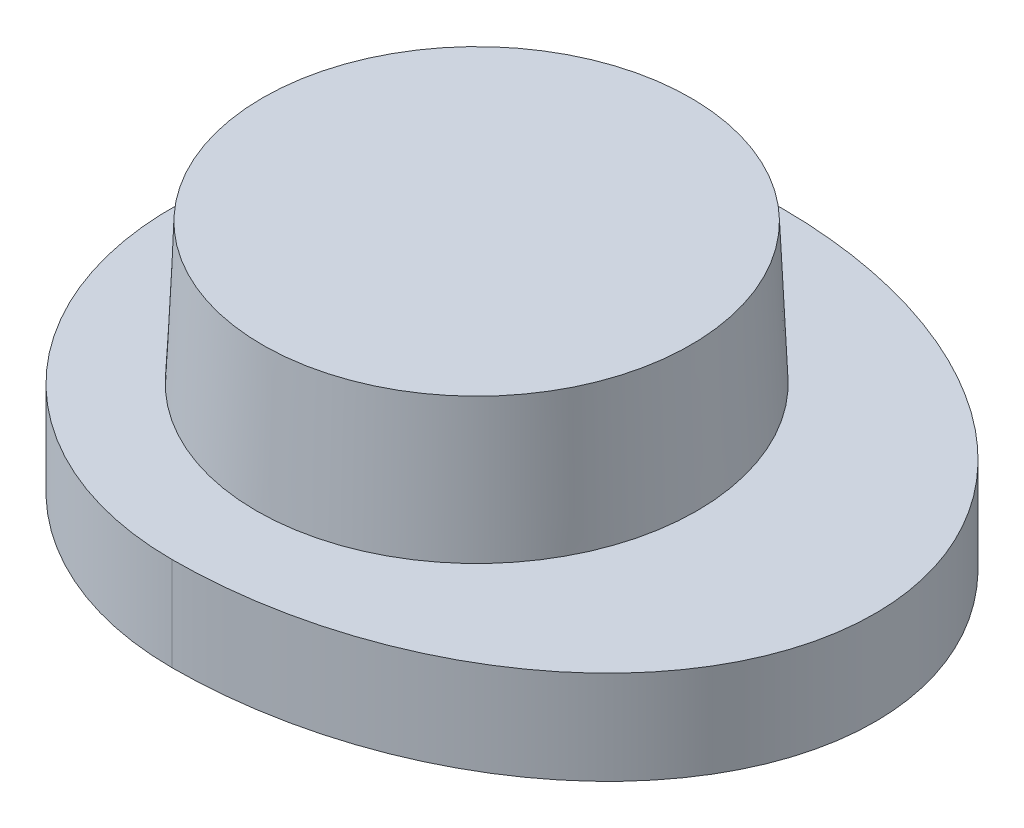
ISO-10303-21;
HEADER;
FILE_DESCRIPTION(('STEP AP214'),'2;1');
FILE_NAME('part.step','',(''),(''),'','','');
FILE_SCHEMA(('AUTOMOTIVE_DESIGN { 1 0 10303 214 1 1 1 1 }'));
ENDSEC;
DATA;
#1=APPLICATION_CONTEXT('core data for automotive mechanical design processes');
#2=APPLICATION_PROTOCOL_DEFINITION('international standard','automotive_design',2000,#1);
#3=PRODUCT_CONTEXT('',#1,'mechanical');
#4=PRODUCT('Part','Part','',(#3));
#5=PRODUCT_RELATED_PRODUCT_CATEGORY('part','',(#4));
#6=PRODUCT_DEFINITION_FORMATION('','',#4);
#7=PRODUCT_DEFINITION_CONTEXT('part definition',#1,'design');
#8=PRODUCT_DEFINITION('design','',#6,#7);
#9=PRODUCT_DEFINITION_SHAPE('','',#8);
#10=(LENGTH_UNIT() NAMED_UNIT(*) SI_UNIT(.MILLI.,.METRE.));
#11=(NAMED_UNIT(*) PLANE_ANGLE_UNIT() SI_UNIT($,.RADIAN.));
#12=(NAMED_UNIT(*) SI_UNIT($,.STERADIAN.) SOLID_ANGLE_UNIT());
#13=UNCERTAINTY_MEASURE_WITH_UNIT(LENGTH_MEASURE(1.E-05),#10,'distance_accuracy_value','');
#14=(GEOMETRIC_REPRESENTATION_CONTEXT(3) GLOBAL_UNCERTAINTY_ASSIGNED_CONTEXT((#13)) GLOBAL_UNIT_ASSIGNED_CONTEXT((#10,
#11,#12)) REPRESENTATION_CONTEXT('',''));
#15=CARTESIAN_POINT('',(0.,0.,0.));
#16=DIRECTION('',(0.,0.,1.));
#17=DIRECTION('',(1.,0.,0.));
#18=AXIS2_PLACEMENT_3D('',#15,#16,#17);
#19=CARTESIAN_POINT('',(3.32292633199457,1.70645834879945,-5.34168726011664E-07));
#20=DIRECTION('',(0.,1.,0.));
#21=DIRECTION('',(-1.,0.,0.));
#22=AXIS2_PLACEMENT_3D('',#19,#20,#21);
#23=PLANE('',#22);
#24=CARTESIAN_POINT('',(22.1229263319946,1.70645834879946,-5.34168726011664E-07));
#25=DIRECTION('',(0.,1.,0.));
#26=DIRECTION('',(-1.,0.,0.));
#27=AXIS2_PLACEMENT_3D('',#24,#25,#26);
#28=CIRCLE('',#27,3.41818181818182);
#29=CARTESIAN_POINT('',(18.7047445138127,1.70645834879945,-5.34168726011664E-07));
#30=VERTEX_POINT('',#29);
#31=EDGE_CURVE('E11',#30,#30,#28,.T.);
#32=ORIENTED_EDGE('',*,*,#31,.F.);
#33=EDGE_LOOP('',(#32));
#34=FACE_BOUND('',#33,.T.);
#35=ADVANCED_FACE('F43',(#34),#23,.F.);
#36=CARTESIAN_POINT('',(22.1229263319946,15.3412072266021,-5.34168726011664E-07));
#37=DIRECTION('',(0.,1.,0.));
#38=DIRECTION('',(-1.,0.,0.));
#39=AXIS2_PLACEMENT_3D('',#36,#37,#38);
#40=CYLINDRICAL_SURFACE('',#39,3.41818181818182);
#41=CARTESIAN_POINT('',(22.1229263319946,-1.71172346938236,-5.34168726011664E-07));
#42=DIRECTION('',(0.,1.,0.));
#43=DIRECTION('',(-1.,0.,0.));
#44=AXIS2_PLACEMENT_3D('',#41,#42,#43);
#45=CIRCLE('',#44,3.41818181818182);
#46=CARTESIAN_POINT('',(18.7047445138127,-1.71172346938236,-5.34168726011664E-07));
#47=VERTEX_POINT('',#46);
#48=EDGE_CURVE('E51',#47,#47,#45,.T.);
#49=ORIENTED_EDGE('',*,*,#48,.F.);
#50=EDGE_LOOP('',(#49));
#51=FACE_BOUND('',#50,.T.);
#52=ORIENTED_EDGE('',*,*,#31,.T.);
#53=EDGE_LOOP('',(#52));
#54=FACE_BOUND('',#53,.T.);
#55=ADVANCED_FACE('F102',(#51,#54),#40,.F.);
#56=CARTESIAN_POINT('',(3.32292633199457,-1.71172346938236,-5.34168726011664E-07));
#57=DIRECTION('',(0.,1.,0.));
#58=DIRECTION('',(-1.,0.,0.));
#59=AXIS2_PLACEMENT_3D('',#56,#57,#58);
#60=PLANE('',#59);
#61=CARTESIAN_POINT('',(22.1229263319946,-1.71172346938236,-5.34168726011664E-07));
#62=DIRECTION('',(0.,-1.,0.));
#63=DIRECTION('',(-1.,0.,0.));
#64=AXIS2_PLACEMENT_3D('',#61,#62,#63);
#65=ELLIPSE('',#64,7.26363636363636,5.55454545454545);
#66=CARTESIAN_POINT('',(22.1229263319946,-1.71172346938236,-5.55454598871418));
#67=VERTEX_POINT('',#66);
#68=CARTESIAN_POINT('',(22.1229263319946,-1.71172346938236,5.55454492037673));
#69=VERTEX_POINT('',#68);
#70=EDGE_CURVE('E58',#67,#69,#65,.T.);
#71=ORIENTED_EDGE('',*,*,#70,.T.);
#72=CARTESIAN_POINT('',(22.1229263319946,-1.71172346938236,-5.34168726011664E-07));
#73=DIRECTION('',(0.,1.,0.));
#74=DIRECTION('',(-1.,0.,0.));
#75=AXIS2_PLACEMENT_3D('',#72,#73,#74);
#76=CIRCLE('',#75,5.55454545454545);
#77=EDGE_CURVE('E87',#67,#69,#76,.T.);
#78=ORIENTED_EDGE('',*,*,#77,.F.);
#79=EDGE_LOOP('',(#71,#78));
#80=FACE_BOUND('',#79,.T.);
#81=ORIENTED_EDGE('',*,*,#48,.T.);
#82=EDGE_LOOP('',(#81));
#83=FACE_BOUND('',#82,.T.);
#84=ADVANCED_FACE('F100',(#80,#83),#60,.F.);
#85=CARTESIAN_POINT('',(22.1229263319946,15.3412072266021,-5.34168726011664E-07));
#86=DIRECTION('',(0.,1.,0.));
#87=DIRECTION('',(-1.,0.,0.));
#88=AXIS2_PLACEMENT_3D('',#85,#86,#87);
#89=CYLINDRICAL_SURFACE('',#88,5.55454545454545);
#90=DIRECTION('',(0.,-1.,0.));
#91=VECTOR('',#90,1.);
#92=CARTESIAN_POINT('',(22.1229263319946,13.2703880184474,5.55454492037673));
#93=LINE('',#92,#91);
#94=CARTESIAN_POINT('',(22.1229263319946,-0.00260388426948021,5.55454492037673));
#95=VERTEX_POINT('',#94);
#96=EDGE_CURVE('E64',#95,#69,#93,.T.);
#97=ORIENTED_EDGE('',*,*,#96,.F.);
#98=CARTESIAN_POINT('',(22.1229263319946,-0.00260388426948317,-5.34168726011664E-07));
#99=DIRECTION('',(0.,1.,0.));
#100=DIRECTION('',(-1.,0.,0.));
#101=AXIS2_PLACEMENT_3D('',#98,#99,#100);
#102=CIRCLE('',#101,5.55454545454545);
#103=CARTESIAN_POINT('',(22.1229263319946,-0.00260388426948317,-5.55454598871418));
#104=VERTEX_POINT('',#103);
#105=EDGE_CURVE('E74',#104,#95,#102,.T.);
#106=ORIENTED_EDGE('',*,*,#105,.F.);
#107=DIRECTION('',(0.,-1.,0.));
#108=VECTOR('',#107,1.);
#109=CARTESIAN_POINT('',(22.1229263319946,13.2703880184474,-5.55454598871418));
#110=LINE('',#109,#108);
#111=EDGE_CURVE('E77',#104,#67,#110,.T.);
#112=ORIENTED_EDGE('',*,*,#111,.T.);
#113=ORIENTED_EDGE('',*,*,#77,.T.);
#114=EDGE_LOOP('',(#97,#106,#112,#113));
#115=FACE_BOUND('',#114,.T.);
#116=ADVANCED_FACE('F85',(#115),#89,.T.);
#117=CARTESIAN_POINT('',(3.32292633199457,-0.00260388426948783,-5.34168726011664E-07));
#118=DIRECTION('',(0.,1.,0.));
#119=DIRECTION('',(-1.,0.,0.));
#120=AXIS2_PLACEMENT_3D('',#117,#118,#119);
#121=PLANE('',#120);
#122=ORIENTED_EDGE('',*,*,#105,.T.);
#123=CARTESIAN_POINT('',(22.1229263319946,-0.00260388426948317,-5.34168726011664E-07));
#124=DIRECTION('',(0.,-1.,0.));
#125=DIRECTION('',(-1.,0.,0.));
#126=AXIS2_PLACEMENT_3D('',#123,#124,#125);
#127=ELLIPSE('',#126,7.26363636363636,5.55454545454545);
#128=EDGE_CURVE('E70',#104,#95,#127,.T.);
#129=ORIENTED_EDGE('',*,*,#128,.F.);
#130=EDGE_LOOP('',(#122,#129));
#131=FACE_BOUND('',#130,.T.);
#132=CARTESIAN_POINT('',(22.1229263319946,-0.0026038842694891,-5.34168726011664E-07));
#133=DIRECTION('',(0.,1.,0.));
#134=DIRECTION('',(-1.,0.,0.));
#135=AXIS2_PLACEMENT_3D('',#132,#133,#134);
#136=CIRCLE('',#135,4.01636363636363);
#137=CARTESIAN_POINT('',(18.1065626956309,-0.00260388426948949,-5.34168726011664E-07));
#138=VERTEX_POINT('',#137);
#139=EDGE_CURVE('E88',#138,#138,#136,.T.);
#140=ORIENTED_EDGE('',*,*,#139,.F.);
#141=EDGE_LOOP('',(#140));
#142=FACE_BOUND('',#141,.T.);
#143=ADVANCED_FACE('F71',(#131,#142),#121,.T.);
#144=CARTESIAN_POINT('',(22.1229263319946,2.56100380334491,-5.34168726011664E-07));
#145=DIRECTION('',(0.,-1.,0.));
#146=DIRECTION('',(1.,0.,0.));
#147=AXIS2_PLACEMENT_3D('',#144,#145,#146);
#148=CONICAL_SURFACE('',#147,3.9044341074749,0.0436332312998501);
#149=ORIENTED_EDGE('',*,*,#139,.T.);
#150=EDGE_LOOP('',(#149));
#151=FACE_BOUND('',#150,.T.);
#152=CARTESIAN_POINT('',(22.1229263319946,2.56100380334491,-5.34168726011664E-07));
#153=DIRECTION('',(0.,1.,0.));
#154=DIRECTION('',(-1.,0.,0.));
#155=AXIS2_PLACEMENT_3D('',#152,#153,#154);
#156=CIRCLE('',#155,3.9044341074749);
#157=CARTESIAN_POINT('',(18.2184922245197,2.56100380334491,-5.34168726011664E-07));
#158=VERTEX_POINT('',#157);
#159=EDGE_CURVE('E83',#158,#158,#156,.T.);
#160=ORIENTED_EDGE('',*,*,#159,.F.);
#161=EDGE_LOOP('',(#160));
#162=FACE_BOUND('',#161,.T.);
#163=ADVANCED_FACE('F138',(#151,#162),#148,.T.);
#164=CARTESIAN_POINT('',(3.32292633199457,2.56100380334491,-5.34168726011664E-07));
#165=DIRECTION('',(0.,-1.,0.));
#166=DIRECTION('',(1.,0.,0.));
#167=AXIS2_PLACEMENT_3D('',#164,#165,#166);
#168=PLANE('',#167);
#169=ORIENTED_EDGE('',*,*,#159,.T.);
#170=EDGE_LOOP('',(#169));
#171=FACE_BOUND('',#170,.T.);
#172=ADVANCED_FACE('F145',(#171),#168,.F.);
#173=CARTESIAN_POINT('',(22.1229263319946,13.2703880184474,-5.34168726011664E-07));
#174=DIRECTION('',(0.,-1.,0.));
#175=DIRECTION('',(-1.,0.,0.));
#176=AXIS2_PLACEMENT_3D('',#173,#174,#175);
#177=ELLIPSE('',#176,7.26363636363636,5.55454545454545);
#178=DIRECTION('',(0.,-1.,0.));
#179=VECTOR('',#178,1.);
#180=SURFACE_OF_LINEAR_EXTRUSION('',#177,#179);
#181=ORIENTED_EDGE('',*,*,#111,.F.);
#182=ORIENTED_EDGE('',*,*,#128,.T.);
#183=ORIENTED_EDGE('',*,*,#96,.T.);
#184=ORIENTED_EDGE('',*,*,#70,.F.);
#185=EDGE_LOOP('',(#181,#182,#183,#184));
#186=FACE_BOUND('',#185,.T.);
#187=ADVANCED_FACE('F78',(#186),#180,.T.);
#188=CLOSED_SHELL('',(#35,#55,#84,#116,#143,#163,#172,#187));
#189=MANIFOLD_SOLID_BREP('B2',#188);
#190=ADVANCED_BREP_SHAPE_REPRESENTATION('',(#18,#189),#14);
#191=SHAPE_DEFINITION_REPRESENTATION(#9,#190);
ENDSEC;
END-ISO-10303-21;
